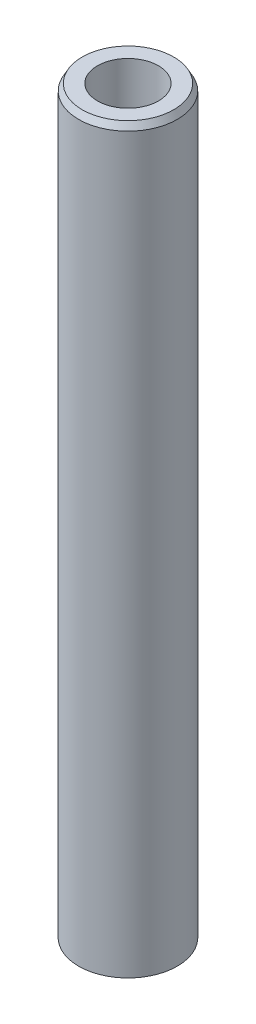
ISO-10303-21;
HEADER;
FILE_DESCRIPTION(('STEP AP214'),'2;1');
FILE_NAME('part.step','',(''),(''),'','','');
FILE_SCHEMA(('AUTOMOTIVE_DESIGN { 1 0 10303 214 1 1 1 1 }'));
ENDSEC;
DATA;
#1=APPLICATION_CONTEXT('core data for automotive mechanical design processes');
#2=APPLICATION_PROTOCOL_DEFINITION('international standard','automotive_design',2000,#1);
#3=PRODUCT_CONTEXT('',#1,'mechanical');
#4=PRODUCT('Part','Part','',(#3));
#5=PRODUCT_RELATED_PRODUCT_CATEGORY('part','',(#4));
#6=PRODUCT_DEFINITION_FORMATION('','',#4);
#7=PRODUCT_DEFINITION_CONTEXT('part definition',#1,'design');
#8=PRODUCT_DEFINITION('design','',#6,#7);
#9=PRODUCT_DEFINITION_SHAPE('','',#8);
#10=(LENGTH_UNIT() NAMED_UNIT(*) SI_UNIT(.MILLI.,.METRE.));
#11=(NAMED_UNIT(*) PLANE_ANGLE_UNIT() SI_UNIT($,.RADIAN.));
#12=(NAMED_UNIT(*) SI_UNIT($,.STERADIAN.) SOLID_ANGLE_UNIT());
#13=UNCERTAINTY_MEASURE_WITH_UNIT(LENGTH_MEASURE(1.E-05),#10,'distance_accuracy_value','');
#14=(GEOMETRIC_REPRESENTATION_CONTEXT(3) GLOBAL_UNCERTAINTY_ASSIGNED_CONTEXT((#13)) GLOBAL_UNIT_ASSIGNED_CONTEXT((#10,
#11,#12)) REPRESENTATION_CONTEXT('',''));
#15=CARTESIAN_POINT('',(0.,0.,0.));
#16=DIRECTION('',(0.,0.,1.));
#17=DIRECTION('',(1.,0.,0.));
#18=AXIS2_PLACEMENT_3D('',#15,#16,#17);
#19=CARTESIAN_POINT('',(0.,414.265991955493,0.));
#20=DIRECTION('',(0.,-1.,0.));
#21=DIRECTION('',(0.,0.,-1.));
#22=AXIS2_PLACEMENT_3D('',#19,#20,#21);
#23=CYLINDRICAL_SURFACE('',#22,27.5);
#24=CARTESIAN_POINT('',(0.,410.615171834926,0.));
#25=DIRECTION('',(0.,1.,0.));
#26=DIRECTION('',(0.,0.,1.));
#27=AXIS2_PLACEMENT_3D('',#24,#25,#26);
#28=CIRCLE('',#27,27.5);
#29=CARTESIAN_POINT('',(0.,410.615171834926,27.5));
#30=VERTEX_POINT('',#29);
#31=EDGE_CURVE('E50',#30,#30,#28,.F.);
#32=ORIENTED_EDGE('',*,*,#31,.T.);
#33=EDGE_LOOP('',(#32));
#34=FACE_BOUND('',#33,.T.);
#35=CARTESIAN_POINT('',(0.,2.01294765855115,0.));
#36=DIRECTION('',(0.,1.,0.));
#37=DIRECTION('',(0.,0.,1.));
#38=AXIS2_PLACEMENT_3D('',#35,#36,#37);
#39=CIRCLE('',#38,27.5);
#40=CARTESIAN_POINT('',(0.,2.01294765855115,27.5));
#41=VERTEX_POINT('',#40);
#42=EDGE_CURVE('E51',#41,#41,#39,.T.);
#43=ORIENTED_EDGE('',*,*,#42,.T.);
#44=EDGE_LOOP('',(#43));
#45=FACE_BOUND('',#44,.T.);
#46=ADVANCED_FACE('F39',(#34,#45),#23,.T.);
#47=CARTESIAN_POINT('',(0.,414.265991955493,0.));
#48=DIRECTION('',(0.,1.,0.));
#49=DIRECTION('',(0.,0.,1.));
#50=AXIS2_PLACEMENT_3D('',#47,#48,#49);
#51=PLANE('',#50);
#52=CARTESIAN_POINT('',(0.,414.265991955493,0.));
#53=DIRECTION('',(0.,1.,0.));
#54=DIRECTION('',(0.,0.,1.));
#55=AXIS2_PLACEMENT_3D('',#52,#53,#54);
#56=CIRCLE('',#55,25.4870523414488);
#57=CARTESIAN_POINT('',(0.,414.265991955493,25.4870523414488));
#58=VERTEX_POINT('',#57);
#59=EDGE_CURVE('E54',#58,#58,#56,.T.);
#60=ORIENTED_EDGE('',*,*,#59,.T.);
#61=EDGE_LOOP('',(#60));
#62=FACE_BOUND('',#61,.T.);
#63=CARTESIAN_POINT('',(0.,414.265991955493,0.));
#64=DIRECTION('',(0.,1.,0.));
#65=DIRECTION('',(0.,0.,1.));
#66=AXIS2_PLACEMENT_3D('',#63,#64,#65);
#67=CIRCLE('',#66,16.9996732675444);
#68=CARTESIAN_POINT('',(0.,414.265991955493,16.9996732675444));
#69=VERTEX_POINT('',#68);
#70=EDGE_CURVE('E58',#69,#69,#67,.T.);
#71=ORIENTED_EDGE('',*,*,#70,.F.);
#72=EDGE_LOOP('',(#71));
#73=FACE_BOUND('',#72,.T.);
#74=ADVANCED_FACE('F69',(#62,#73),#51,.T.);
#75=CARTESIAN_POINT('',(0.,0.,0.));
#76=DIRECTION('',(0.,1.,0.));
#77=DIRECTION('',(0.,0.,1.));
#78=AXIS2_PLACEMENT_3D('',#75,#76,#77);
#79=PLANE('',#78);
#80=CARTESIAN_POINT('',(0.,0.,0.));
#81=DIRECTION('',(0.,1.,0.));
#82=DIRECTION('',(0.,0.,1.));
#83=AXIS2_PLACEMENT_3D('',#80,#81,#82);
#84=CIRCLE('',#83,23.8491798794327);
#85=CARTESIAN_POINT('',(0.,0.,23.8491798794327));
#86=VERTEX_POINT('',#85);
#87=EDGE_CURVE('E10',#86,#86,#84,.F.);
#88=ORIENTED_EDGE('',*,*,#87,.T.);
#89=EDGE_LOOP('',(#88));
#90=FACE_BOUND('',#89,.T.);
#91=CARTESIAN_POINT('',(0.,0.,0.));
#92=DIRECTION('',(0.,1.,0.));
#93=DIRECTION('',(0.,0.,1.));
#94=AXIS2_PLACEMENT_3D('',#91,#92,#93);
#95=CIRCLE('',#94,16.9996732675444);
#96=CARTESIAN_POINT('',(0.,0.,16.9996732675444));
#97=VERTEX_POINT('',#96);
#98=EDGE_CURVE('E63',#97,#97,#95,.T.);
#99=ORIENTED_EDGE('',*,*,#98,.T.);
#100=EDGE_LOOP('',(#99));
#101=FACE_BOUND('',#100,.T.);
#102=ADVANCED_FACE('F75',(#90,#101),#79,.F.);
#103=CARTESIAN_POINT('',(0.,414.265991955493,0.));
#104=DIRECTION('',(0.,-1.,0.));
#105=DIRECTION('',(0.,0.,-1.));
#106=AXIS2_PLACEMENT_3D('',#103,#104,#105);
#107=CYLINDRICAL_SURFACE('',#106,16.9996732675444);
#108=ORIENTED_EDGE('',*,*,#70,.T.);
#109=EDGE_LOOP('',(#108));
#110=FACE_BOUND('',#109,.T.);
#111=ORIENTED_EDGE('',*,*,#98,.F.);
#112=EDGE_LOOP('',(#111));
#113=FACE_BOUND('',#112,.T.);
#114=ADVANCED_FACE('F70',(#110,#113),#107,.F.);
#115=CARTESIAN_POINT('',(0.,414.265991955493,0.));
#116=DIRECTION('',(0.,-1.,0.));
#117=DIRECTION('',(0.,0.,-1.));
#118=AXIS2_PLACEMENT_3D('',#115,#116,#117);
#119=CONICAL_SURFACE('',#118,25.4870523414488,0.503893368980026);
#120=ORIENTED_EDGE('',*,*,#31,.F.);
#121=EDGE_LOOP('',(#120));
#122=FACE_BOUND('',#121,.T.);
#123=ORIENTED_EDGE('',*,*,#59,.F.);
#124=EDGE_LOOP('',(#123));
#125=FACE_BOUND('',#124,.T.);
#126=ADVANCED_FACE('F81',(#122,#125),#119,.T.);
#127=CARTESIAN_POINT('',(0.,2.01294765855115,0.));
#128=DIRECTION('',(0.,1.,0.));
#129=DIRECTION('',(0.,0.,1.));
#130=AXIS2_PLACEMENT_3D('',#127,#128,#129);
#131=CONICAL_SURFACE('',#130,27.5,1.06690295781487);
#132=ORIENTED_EDGE('',*,*,#87,.F.);
#133=EDGE_LOOP('',(#132));
#134=FACE_BOUND('',#133,.T.);
#135=ORIENTED_EDGE('',*,*,#42,.F.);
#136=EDGE_LOOP('',(#135));
#137=FACE_BOUND('',#136,.T.);
#138=ADVANCED_FACE('F45',(#134,#137),#131,.T.);
#139=CLOSED_SHELL('',(#46,#74,#102,#114,#126,#138));
#140=MANIFOLD_SOLID_BREP('B2',#139);
#141=ADVANCED_BREP_SHAPE_REPRESENTATION('',(#18,#140),#14);
#142=SHAPE_DEFINITION_REPRESENTATION(#9,#141);
ENDSEC;
END-ISO-10303-21;
